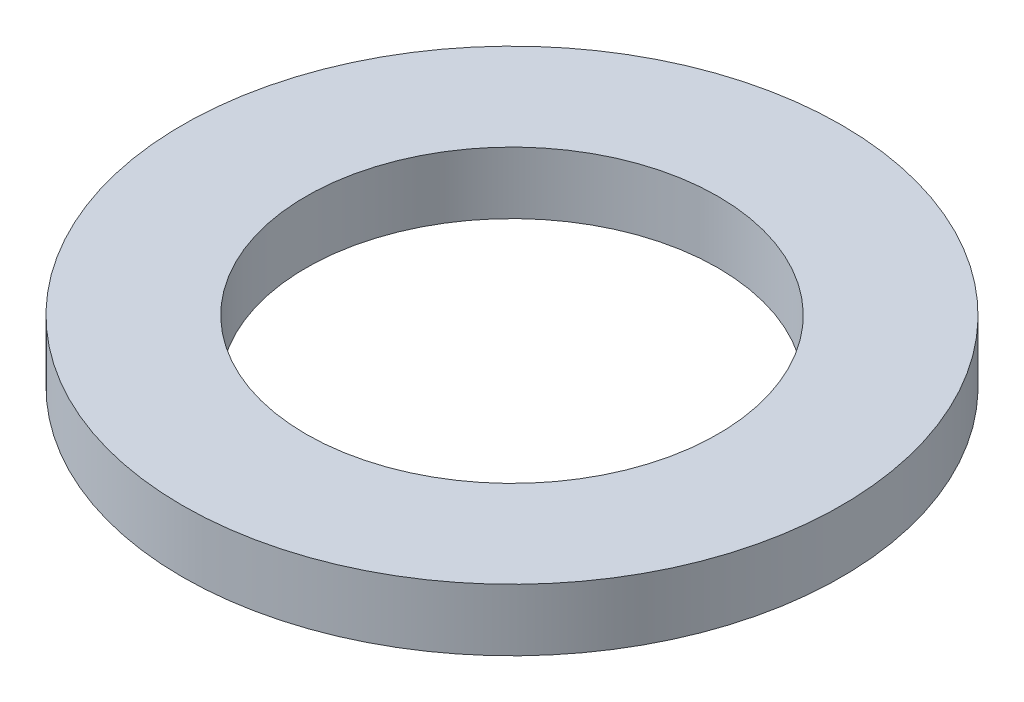
ISO-10303-21;
HEADER;
FILE_DESCRIPTION(('STEP AP214'),'2;1');
FILE_NAME('part.step','',(''),(''),'','','');
FILE_SCHEMA(('AUTOMOTIVE_DESIGN { 1 0 10303 214 1 1 1 1 }'));
ENDSEC;
DATA;
#1=APPLICATION_CONTEXT('core data for automotive mechanical design processes');
#2=APPLICATION_PROTOCOL_DEFINITION('international standard','automotive_design',2000,#1);
#3=PRODUCT_CONTEXT('',#1,'mechanical');
#4=PRODUCT('Part','Part','',(#3));
#5=PRODUCT_RELATED_PRODUCT_CATEGORY('part','',(#4));
#6=PRODUCT_DEFINITION_FORMATION('','',#4);
#7=PRODUCT_DEFINITION_CONTEXT('part definition',#1,'design');
#8=PRODUCT_DEFINITION('design','',#6,#7);
#9=PRODUCT_DEFINITION_SHAPE('','',#8);
#10=(LENGTH_UNIT() NAMED_UNIT(*) SI_UNIT(.MILLI.,.METRE.));
#11=(NAMED_UNIT(*) PLANE_ANGLE_UNIT() SI_UNIT($,.RADIAN.));
#12=(NAMED_UNIT(*) SI_UNIT($,.STERADIAN.) SOLID_ANGLE_UNIT());
#13=UNCERTAINTY_MEASURE_WITH_UNIT(LENGTH_MEASURE(1.E-05),#10,'distance_accuracy_value','');
#14=(GEOMETRIC_REPRESENTATION_CONTEXT(3) GLOBAL_UNCERTAINTY_ASSIGNED_CONTEXT((#13)) GLOBAL_UNIT_ASSIGNED_CONTEXT((#10,
#11,#12)) REPRESENTATION_CONTEXT('',''));
#15=CARTESIAN_POINT('',(0.,0.,0.));
#16=DIRECTION('',(0.,0.,1.));
#17=DIRECTION('',(1.,0.,0.));
#18=AXIS2_PLACEMENT_3D('',#15,#16,#17);
#19=CARTESIAN_POINT('',(0.,2.3876,0.));
#20=DIRECTION('',(0.,1.,0.));
#21=DIRECTION('',(0.,0.,1.));
#22=AXIS2_PLACEMENT_3D('',#19,#20,#21);
#23=PLANE('',#22);
#24=CARTESIAN_POINT('',(0.,2.3876,0.));
#25=DIRECTION('',(0.,1.,0.));
#26=DIRECTION('',(0.,0.,1.));
#27=AXIS2_PLACEMENT_3D('',#24,#25,#26);
#28=CIRCLE('',#27,12.7);
#29=CARTESIAN_POINT('',(0.,2.3876,12.7));
#30=VERTEX_POINT('',#29);
#31=EDGE_CURVE('E10',#30,#30,#28,.T.);
#32=ORIENTED_EDGE('',*,*,#31,.T.);
#33=EDGE_LOOP('',(#32));
#34=FACE_BOUND('',#33,.T.);
#35=CARTESIAN_POINT('',(0.,2.3876,0.));
#36=DIRECTION('',(0.,1.,0.));
#37=DIRECTION('',(0.,0.,1.));
#38=AXIS2_PLACEMENT_3D('',#35,#36,#37);
#39=CIRCLE('',#38,7.9375);
#40=CARTESIAN_POINT('',(0.,2.3876,7.9375));
#41=VERTEX_POINT('',#40);
#42=EDGE_CURVE('E43',#41,#41,#39,.T.);
#43=ORIENTED_EDGE('',*,*,#42,.F.);
#44=EDGE_LOOP('',(#43));
#45=FACE_BOUND('',#44,.T.);
#46=ADVANCED_FACE('F32',(#34,#45),#23,.T.);
#47=CARTESIAN_POINT('',(0.,0.,0.));
#48=DIRECTION('',(0.,1.,0.));
#49=DIRECTION('',(0.,0.,1.));
#50=AXIS2_PLACEMENT_3D('',#47,#48,#49);
#51=PLANE('',#50);
#52=CARTESIAN_POINT('',(0.,0.,0.));
#53=DIRECTION('',(0.,1.,0.));
#54=DIRECTION('',(0.,0.,1.));
#55=AXIS2_PLACEMENT_3D('',#52,#53,#54);
#56=CIRCLE('',#55,12.7);
#57=CARTESIAN_POINT('',(0.,0.,12.7));
#58=VERTEX_POINT('',#57);
#59=EDGE_CURVE('E36',#58,#58,#56,.T.);
#60=ORIENTED_EDGE('',*,*,#59,.F.);
#61=EDGE_LOOP('',(#60));
#62=FACE_BOUND('',#61,.T.);
#63=CARTESIAN_POINT('',(0.,0.,0.));
#64=DIRECTION('',(0.,1.,0.));
#65=DIRECTION('',(0.,0.,1.));
#66=AXIS2_PLACEMENT_3D('',#63,#64,#65);
#67=CIRCLE('',#66,7.9375);
#68=CARTESIAN_POINT('',(0.,0.,7.9375));
#69=VERTEX_POINT('',#68);
#70=EDGE_CURVE('E45',#69,#69,#67,.T.);
#71=ORIENTED_EDGE('',*,*,#70,.T.);
#72=EDGE_LOOP('',(#71));
#73=FACE_BOUND('',#72,.T.);
#74=ADVANCED_FACE('F55',(#62,#73),#51,.F.);
#75=CARTESIAN_POINT('',(0.,2.3876,0.));
#76=DIRECTION('',(0.,-1.,0.));
#77=DIRECTION('',(0.,0.,-1.));
#78=AXIS2_PLACEMENT_3D('',#75,#76,#77);
#79=CYLINDRICAL_SURFACE('',#78,12.7);
#80=ORIENTED_EDGE('',*,*,#31,.F.);
#81=EDGE_LOOP('',(#80));
#82=FACE_BOUND('',#81,.T.);
#83=ORIENTED_EDGE('',*,*,#59,.T.);
#84=EDGE_LOOP('',(#83));
#85=FACE_BOUND('',#84,.T.);
#86=ADVANCED_FACE('F34',(#82,#85),#79,.T.);
#87=CARTESIAN_POINT('',(0.,2.3876,0.));
#88=DIRECTION('',(0.,-1.,0.));
#89=DIRECTION('',(0.,0.,-1.));
#90=AXIS2_PLACEMENT_3D('',#87,#88,#89);
#91=CYLINDRICAL_SURFACE('',#90,7.9375);
#92=ORIENTED_EDGE('',*,*,#42,.T.);
#93=EDGE_LOOP('',(#92));
#94=FACE_BOUND('',#93,.T.);
#95=ORIENTED_EDGE('',*,*,#70,.F.);
#96=EDGE_LOOP('',(#95));
#97=FACE_BOUND('',#96,.T.);
#98=ADVANCED_FACE('F51',(#94,#97),#91,.F.);
#99=CLOSED_SHELL('',(#46,#74,#86,#98));
#100=MANIFOLD_SOLID_BREP('B2',#99);
#101=ADVANCED_BREP_SHAPE_REPRESENTATION('',(#18,#100),#14);
#102=SHAPE_DEFINITION_REPRESENTATION(#9,#101);
ENDSEC;
END-ISO-10303-21;
